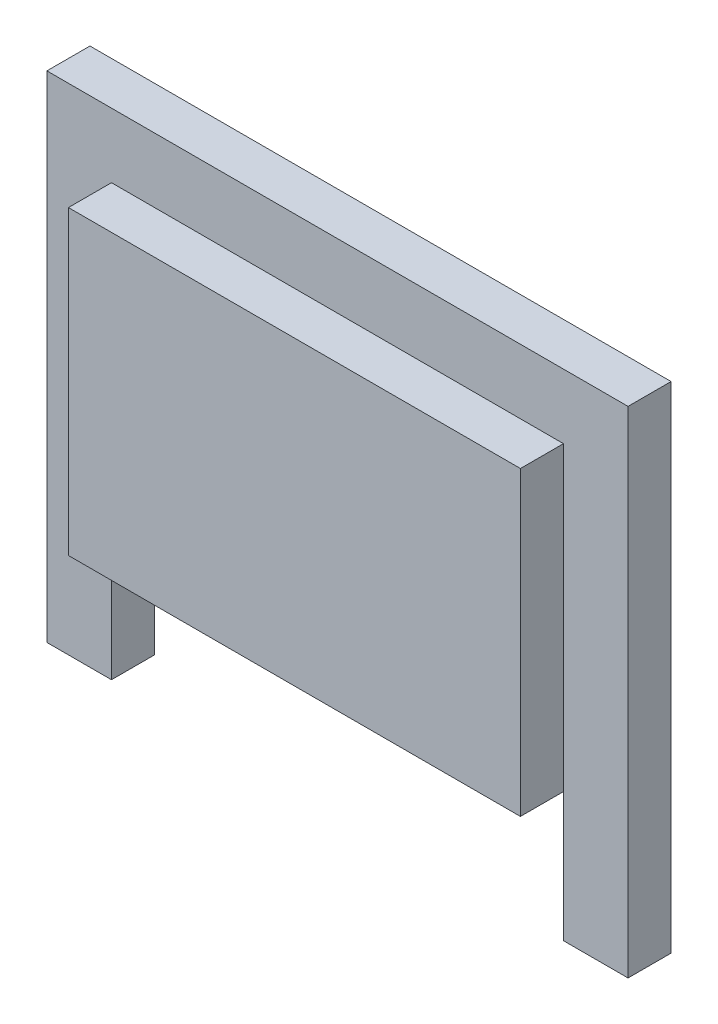
ISO-10303-21;
HEADER;
FILE_DESCRIPTION(('STEP AP214'),'2;1');
FILE_NAME('part.step','',(''),(''),'','','');
FILE_SCHEMA(('AUTOMOTIVE_DESIGN { 1 0 10303 214 1 1 1 1 }'));
ENDSEC;
DATA;
#1=APPLICATION_CONTEXT('core data for automotive mechanical design processes');
#2=APPLICATION_PROTOCOL_DEFINITION('international standard','automotive_design',2000,#1);
#3=PRODUCT_CONTEXT('',#1,'mechanical');
#4=PRODUCT('Part','Part','',(#3));
#5=PRODUCT_RELATED_PRODUCT_CATEGORY('part','',(#4));
#6=PRODUCT_DEFINITION_FORMATION('','',#4);
#7=PRODUCT_DEFINITION_CONTEXT('part definition',#1,'design');
#8=PRODUCT_DEFINITION('design','',#6,#7);
#9=PRODUCT_DEFINITION_SHAPE('','',#8);
#10=(LENGTH_UNIT() NAMED_UNIT(*) SI_UNIT(.MILLI.,.METRE.));
#11=(NAMED_UNIT(*) PLANE_ANGLE_UNIT() SI_UNIT($,.RADIAN.));
#12=(NAMED_UNIT(*) SI_UNIT($,.STERADIAN.) SOLID_ANGLE_UNIT());
#13=UNCERTAINTY_MEASURE_WITH_UNIT(LENGTH_MEASURE(1.E-05),#10,'distance_accuracy_value','');
#14=(GEOMETRIC_REPRESENTATION_CONTEXT(3) GLOBAL_UNCERTAINTY_ASSIGNED_CONTEXT((#13)) GLOBAL_UNIT_ASSIGNED_CONTEXT((#10,
#11,#12)) REPRESENTATION_CONTEXT('',''));
#15=CARTESIAN_POINT('',(0.,0.,0.));
#16=DIRECTION('',(0.,0.,1.));
#17=DIRECTION('',(1.,0.,0.));
#18=AXIS2_PLACEMENT_3D('',#15,#16,#17);
#19=CARTESIAN_POINT('',(-13.5,-11.5,2.));
#20=DIRECTION('',(0.,1.,0.));
#21=DIRECTION('',(0.,0.,1.));
#22=AXIS2_PLACEMENT_3D('',#19,#20,#21);
#23=PLANE('',#22);
#24=DIRECTION('',(1.,0.,0.));
#25=VECTOR('',#24,1.);
#26=CARTESIAN_POINT('',(-13.5,-11.5,0.));
#27=LINE('',#26,#25);
#28=CARTESIAN_POINT('',(-13.5,-11.5,0.));
#29=VERTEX_POINT('',#28);
#30=CARTESIAN_POINT('',(-10.5,-11.5,0.));
#31=VERTEX_POINT('',#30);
#32=EDGE_CURVE('E141',#29,#31,#27,.T.);
#33=ORIENTED_EDGE('',*,*,#32,.T.);
#34=DIRECTION('',(0.,0.,1.));
#35=VECTOR('',#34,1.);
#36=CARTESIAN_POINT('',(-10.5,-11.5,0.));
#37=LINE('',#36,#35);
#38=CARTESIAN_POINT('',(-10.5,-11.5,2.));
#39=VERTEX_POINT('',#38);
#40=EDGE_CURVE('E123',#31,#39,#37,.T.);
#41=ORIENTED_EDGE('',*,*,#40,.T.);
#42=DIRECTION('',(1.,0.,0.));
#43=VECTOR('',#42,1.);
#44=CARTESIAN_POINT('',(-13.5,-11.5,2.));
#45=LINE('',#44,#43);
#46=CARTESIAN_POINT('',(-13.5,-11.5,2.));
#47=VERTEX_POINT('',#46);
#48=EDGE_CURVE('E168',#47,#39,#45,.T.);
#49=ORIENTED_EDGE('',*,*,#48,.F.);
#50=DIRECTION('',(0.,0.,-1.));
#51=VECTOR('',#50,1.);
#52=CARTESIAN_POINT('',(-13.5,-11.5,2.));
#53=LINE('',#52,#51);
#54=EDGE_CURVE('E150',#47,#29,#53,.T.);
#55=ORIENTED_EDGE('',*,*,#54,.T.);
#56=EDGE_LOOP('',(#33,#41,#49,#55));
#57=FACE_BOUND('',#56,.T.);
#58=ADVANCED_FACE('F39',(#57),#23,.F.);
#59=CARTESIAN_POINT('',(0.,0.,2.));
#60=DIRECTION('',(0.,0.,-1.));
#61=DIRECTION('',(-1.,0.,0.));
#62=AXIS2_PLACEMENT_3D('',#59,#60,#61);
#63=PLANE('',#62);
#64=ORIENTED_EDGE('',*,*,#48,.T.);
#65=DIRECTION('',(0.,-1.,0.));
#66=VECTOR('',#65,1.);
#67=CARTESIAN_POINT('',(-10.5,-5.5,2.));
#68=LINE('',#67,#66);
#69=CARTESIAN_POINT('',(-10.5,-5.5,2.));
#70=VERTEX_POINT('',#69);
#71=EDGE_CURVE('E128',#70,#39,#68,.T.);
#72=ORIENTED_EDGE('',*,*,#71,.F.);
#73=DIRECTION('',(0.,-1.,0.));
#74=VECTOR('',#73,1.);
#75=CARTESIAN_POINT('',(-10.5,8.5,2.));
#76=LINE('',#75,#74);
#77=CARTESIAN_POINT('',(-10.5,8.5,2.));
#78=VERTEX_POINT('',#77);
#79=EDGE_CURVE('E55',#78,#70,#76,.T.);
#80=ORIENTED_EDGE('',*,*,#79,.F.);
#81=DIRECTION('',(-1.,0.,0.));
#82=VECTOR('',#81,1.);
#83=CARTESIAN_POINT('',(-10.5,8.5,2.));
#84=LINE('',#83,#82);
#85=CARTESIAN_POINT('',(10.5,8.5,2.));
#86=VERTEX_POINT('',#85);
#87=EDGE_CURVE('E59',#86,#78,#84,.T.);
#88=ORIENTED_EDGE('',*,*,#87,.F.);
#89=DIRECTION('',(0.,1.,0.));
#90=VECTOR('',#89,1.);
#91=CARTESIAN_POINT('',(10.5,8.5,2.));
#92=LINE('',#91,#90);
#93=CARTESIAN_POINT('',(10.5,-5.5,2.));
#94=VERTEX_POINT('',#93);
#95=EDGE_CURVE('E214',#94,#86,#92,.T.);
#96=ORIENTED_EDGE('',*,*,#95,.F.);
#97=DIRECTION('',(0.,1.,0.));
#98=VECTOR('',#97,1.);
#99=CARTESIAN_POINT('',(10.5,-5.5,2.));
#100=LINE('',#99,#98);
#101=CARTESIAN_POINT('',(10.5,-11.5,2.));
#102=VERTEX_POINT('',#101);
#103=EDGE_CURVE('E146',#102,#94,#100,.T.);
#104=ORIENTED_EDGE('',*,*,#103,.F.);
#105=CARTESIAN_POINT('',(13.5,-11.5,2.));
#106=VERTEX_POINT('',#105);
#107=EDGE_CURVE('E190',#102,#106,#45,.T.);
#108=ORIENTED_EDGE('',*,*,#107,.T.);
#109=DIRECTION('',(0.,1.,0.));
#110=VECTOR('',#109,1.);
#111=CARTESIAN_POINT('',(13.5,-11.5,2.));
#112=LINE('',#111,#110);
#113=CARTESIAN_POINT('',(13.5,11.5,2.));
#114=VERTEX_POINT('',#113);
#115=EDGE_CURVE('E152',#106,#114,#112,.T.);
#116=ORIENTED_EDGE('',*,*,#115,.T.);
#117=DIRECTION('',(-1.,0.,0.));
#118=VECTOR('',#117,1.);
#119=CARTESIAN_POINT('',(-13.5,11.5,2.));
#120=LINE('',#119,#118);
#121=CARTESIAN_POINT('',(-13.5,11.5,2.));
#122=VERTEX_POINT('',#121);
#123=EDGE_CURVE('E158',#114,#122,#120,.T.);
#124=ORIENTED_EDGE('',*,*,#123,.T.);
#125=DIRECTION('',(0.,-1.,0.));
#126=VECTOR('',#125,1.);
#127=CARTESIAN_POINT('',(-13.5,-11.5,2.));
#128=LINE('',#127,#126);
#129=EDGE_CURVE('E176',#122,#47,#128,.T.);
#130=ORIENTED_EDGE('',*,*,#129,.T.);
#131=EDGE_LOOP('',(#64,#72,#80,#88,#96,#104,#108,#116,#124,#130));
#132=FACE_BOUND('',#131,.T.);
#133=ADVANCED_FACE('F257',(#132),#63,.F.);
#134=CARTESIAN_POINT('',(13.5,-11.5,2.));
#135=DIRECTION('',(-1.,0.,0.));
#136=DIRECTION('',(0.,0.,1.));
#137=AXIS2_PLACEMENT_3D('',#134,#135,#136);
#138=PLANE('',#137);
#139=DIRECTION('',(0.,1.,0.));
#140=VECTOR('',#139,1.);
#141=CARTESIAN_POINT('',(13.5,-11.5,0.));
#142=LINE('',#141,#140);
#143=CARTESIAN_POINT('',(13.5,-11.5,0.));
#144=VERTEX_POINT('',#143);
#145=CARTESIAN_POINT('',(13.5,11.5,0.));
#146=VERTEX_POINT('',#145);
#147=EDGE_CURVE('E182',#144,#146,#142,.T.);
#148=ORIENTED_EDGE('',*,*,#147,.T.);
#149=DIRECTION('',(0.,0.,-1.));
#150=VECTOR('',#149,1.);
#151=CARTESIAN_POINT('',(13.5,11.5,2.));
#152=LINE('',#151,#150);
#153=EDGE_CURVE('E11',#114,#146,#152,.T.);
#154=ORIENTED_EDGE('',*,*,#153,.F.);
#155=ORIENTED_EDGE('',*,*,#115,.F.);
#156=DIRECTION('',(0.,0.,-1.));
#157=VECTOR('',#156,1.);
#158=CARTESIAN_POINT('',(13.5,-11.5,2.));
#159=LINE('',#158,#157);
#160=EDGE_CURVE('E164',#106,#144,#159,.T.);
#161=ORIENTED_EDGE('',*,*,#160,.T.);
#162=EDGE_LOOP('',(#148,#154,#155,#161));
#163=FACE_BOUND('',#162,.T.);
#164=ADVANCED_FACE('F41',(#163),#138,.F.);
#165=CARTESIAN_POINT('',(-13.5,11.5,2.));
#166=DIRECTION('',(0.,-1.,0.));
#167=DIRECTION('',(0.,0.,-1.));
#168=AXIS2_PLACEMENT_3D('',#165,#166,#167);
#169=PLANE('',#168);
#170=DIRECTION('',(-1.,0.,0.));
#171=VECTOR('',#170,1.);
#172=CARTESIAN_POINT('',(-13.5,11.5,0.));
#173=LINE('',#172,#171);
#174=CARTESIAN_POINT('',(-13.5,11.5,0.));
#175=VERTEX_POINT('',#174);
#176=EDGE_CURVE('E179',#146,#175,#173,.T.);
#177=ORIENTED_EDGE('',*,*,#176,.T.);
#178=DIRECTION('',(0.,0.,-1.));
#179=VECTOR('',#178,1.);
#180=CARTESIAN_POINT('',(-13.5,11.5,2.));
#181=LINE('',#180,#179);
#182=EDGE_CURVE('E48',#122,#175,#181,.T.);
#183=ORIENTED_EDGE('',*,*,#182,.F.);
#184=ORIENTED_EDGE('',*,*,#123,.F.);
#185=ORIENTED_EDGE('',*,*,#153,.T.);
#186=EDGE_LOOP('',(#177,#183,#184,#185));
#187=FACE_BOUND('',#186,.T.);
#188=ADVANCED_FACE('F264',(#187),#169,.F.);
#189=CARTESIAN_POINT('',(-13.5,-11.5,2.));
#190=DIRECTION('',(1.,0.,0.));
#191=DIRECTION('',(0.,0.,-1.));
#192=AXIS2_PLACEMENT_3D('',#189,#190,#191);
#193=PLANE('',#192);
#194=DIRECTION('',(0.,-1.,0.));
#195=VECTOR('',#194,1.);
#196=CARTESIAN_POINT('',(-13.5,-11.5,0.));
#197=LINE('',#196,#195);
#198=EDGE_CURVE('E160',#175,#29,#197,.T.);
#199=ORIENTED_EDGE('',*,*,#198,.T.);
#200=ORIENTED_EDGE('',*,*,#54,.F.);
#201=ORIENTED_EDGE('',*,*,#129,.F.);
#202=ORIENTED_EDGE('',*,*,#182,.T.);
#203=EDGE_LOOP('',(#199,#200,#201,#202));
#204=FACE_BOUND('',#203,.T.);
#205=ADVANCED_FACE('F175',(#204),#193,.F.);
#206=ORIENTED_EDGE('',*,*,#107,.F.);
#207=DIRECTION('',(0.,0.,1.));
#208=VECTOR('',#207,1.);
#209=CARTESIAN_POINT('',(10.5,-11.5,0.));
#210=LINE('',#209,#208);
#211=CARTESIAN_POINT('',(10.5,-11.5,0.));
#212=VERTEX_POINT('',#211);
#213=EDGE_CURVE('E134',#212,#102,#210,.T.);
#214=ORIENTED_EDGE('',*,*,#213,.F.);
#215=EDGE_CURVE('E153',#212,#144,#27,.T.);
#216=ORIENTED_EDGE('',*,*,#215,.T.);
#217=ORIENTED_EDGE('',*,*,#160,.F.);
#218=EDGE_LOOP('',(#206,#214,#216,#217));
#219=FACE_BOUND('',#218,.T.);
#220=ADVANCED_FACE('F253',(#219),#23,.F.);
#221=CARTESIAN_POINT('',(0.,0.,0.));
#222=DIRECTION('',(0.,0.,-1.));
#223=DIRECTION('',(-1.,0.,0.));
#224=AXIS2_PLACEMENT_3D('',#221,#222,#223);
#225=PLANE('',#224);
#226=DIRECTION('',(0.,-1.,0.));
#227=VECTOR('',#226,1.);
#228=CARTESIAN_POINT('',(-10.5,-5.5,0.));
#229=LINE('',#228,#227);
#230=CARTESIAN_POINT('',(-10.5,-5.5,0.));
#231=VERTEX_POINT('',#230);
#232=EDGE_CURVE('E126',#231,#31,#229,.T.);
#233=ORIENTED_EDGE('',*,*,#232,.T.);
#234=ORIENTED_EDGE('',*,*,#32,.F.);
#235=ORIENTED_EDGE('',*,*,#198,.F.);
#236=ORIENTED_EDGE('',*,*,#176,.F.);
#237=ORIENTED_EDGE('',*,*,#147,.F.);
#238=ORIENTED_EDGE('',*,*,#215,.F.);
#239=DIRECTION('',(0.,1.,0.));
#240=VECTOR('',#239,1.);
#241=CARTESIAN_POINT('',(10.5,-5.5,0.));
#242=LINE('',#241,#240);
#243=CARTESIAN_POINT('',(10.5,-5.5,0.));
#244=VERTEX_POINT('',#243);
#245=EDGE_CURVE('E145',#212,#244,#242,.T.);
#246=ORIENTED_EDGE('',*,*,#245,.T.);
#247=DIRECTION('',(-1.,0.,0.));
#248=VECTOR('',#247,1.);
#249=CARTESIAN_POINT('',(-10.5,-5.5,0.));
#250=LINE('',#249,#248);
#251=EDGE_CURVE('E135',#244,#231,#250,.T.);
#252=ORIENTED_EDGE('',*,*,#251,.T.);
#253=EDGE_LOOP('',(#233,#234,#235,#236,#237,#238,#246,#252));
#254=FACE_BOUND('',#253,.T.);
#255=ADVANCED_FACE('F139',(#254),#225,.T.);
#256=CARTESIAN_POINT('',(-10.5,8.5,4.));
#257=DIRECTION('',(1.,0.,0.));
#258=DIRECTION('',(0.,1.,0.));
#259=AXIS2_PLACEMENT_3D('',#256,#257,#258);
#260=PLANE('',#259);
#261=ORIENTED_EDGE('',*,*,#79,.T.);
#262=DIRECTION('',(0.,0.,-1.));
#263=VECTOR('',#262,1.);
#264=CARTESIAN_POINT('',(-10.5,-5.5,4.));
#265=LINE('',#264,#263);
#266=CARTESIAN_POINT('',(-10.5,-5.5,4.));
#267=VERTEX_POINT('',#266);
#268=EDGE_CURVE('E185',#267,#70,#265,.T.);
#269=ORIENTED_EDGE('',*,*,#268,.F.);
#270=DIRECTION('',(0.,-1.,0.));
#271=VECTOR('',#270,1.);
#272=CARTESIAN_POINT('',(-10.5,8.5,4.));
#273=LINE('',#272,#271);
#274=CARTESIAN_POINT('',(-10.5,8.5,4.));
#275=VERTEX_POINT('',#274);
#276=EDGE_CURVE('E213',#275,#267,#273,.T.);
#277=ORIENTED_EDGE('',*,*,#276,.F.);
#278=DIRECTION('',(0.,0.,-1.));
#279=VECTOR('',#278,1.);
#280=CARTESIAN_POINT('',(-10.5,8.5,4.));
#281=LINE('',#280,#279);
#282=EDGE_CURVE('E206',#275,#78,#281,.T.);
#283=ORIENTED_EDGE('',*,*,#282,.T.);
#284=EDGE_LOOP('',(#261,#269,#277,#283));
#285=FACE_BOUND('',#284,.T.);
#286=ADVANCED_FACE('F283',(#285),#260,.F.);
#287=CARTESIAN_POINT('',(-10.5,-5.5,4.));
#288=DIRECTION('',(0.,1.,0.));
#289=DIRECTION('',(0.,0.,1.));
#290=AXIS2_PLACEMENT_3D('',#287,#288,#289);
#291=PLANE('',#290);
#292=ORIENTED_EDGE('',*,*,#268,.T.);
#293=DIRECTION('',(0.,0.,1.));
#294=VECTOR('',#293,1.);
#295=CARTESIAN_POINT('',(-10.5,-5.5,0.));
#296=LINE('',#295,#294);
#297=EDGE_CURVE('E219',#231,#70,#296,.T.);
#298=ORIENTED_EDGE('',*,*,#297,.F.);
#299=ORIENTED_EDGE('',*,*,#251,.F.);
#300=DIRECTION('',(0.,0.,1.));
#301=VECTOR('',#300,1.);
#302=CARTESIAN_POINT('',(10.5,-5.5,0.));
#303=LINE('',#302,#301);
#304=EDGE_CURVE('E233',#244,#94,#303,.T.);
#305=ORIENTED_EDGE('',*,*,#304,.T.);
#306=DIRECTION('',(0.,0.,-1.));
#307=VECTOR('',#306,1.);
#308=CARTESIAN_POINT('',(10.5,-5.5,4.));
#309=LINE('',#308,#307);
#310=CARTESIAN_POINT('',(10.5,-5.5,4.));
#311=VERTEX_POINT('',#310);
#312=EDGE_CURVE('E198',#311,#94,#309,.T.);
#313=ORIENTED_EDGE('',*,*,#312,.F.);
#314=DIRECTION('',(1.,0.,0.));
#315=VECTOR('',#314,1.);
#316=CARTESIAN_POINT('',(-10.5,-5.5,4.));
#317=LINE('',#316,#315);
#318=EDGE_CURVE('E225',#267,#311,#317,.T.);
#319=ORIENTED_EDGE('',*,*,#318,.F.);
#320=EDGE_LOOP('',(#292,#298,#299,#305,#313,#319));
#321=FACE_BOUND('',#320,.T.);
#322=ADVANCED_FACE('F261',(#321),#291,.F.);
#323=CARTESIAN_POINT('',(10.5,8.5,4.));
#324=DIRECTION('',(-1.,0.,0.));
#325=DIRECTION('',(0.,-1.,0.));
#326=AXIS2_PLACEMENT_3D('',#323,#324,#325);
#327=PLANE('',#326);
#328=ORIENTED_EDGE('',*,*,#95,.T.);
#329=DIRECTION('',(0.,0.,-1.));
#330=VECTOR('',#329,1.);
#331=CARTESIAN_POINT('',(10.5,8.5,4.));
#332=LINE('',#331,#330);
#333=CARTESIAN_POINT('',(10.5,8.5,4.));
#334=VERTEX_POINT('',#333);
#335=EDGE_CURVE('E202',#334,#86,#332,.T.);
#336=ORIENTED_EDGE('',*,*,#335,.F.);
#337=DIRECTION('',(0.,1.,0.));
#338=VECTOR('',#337,1.);
#339=CARTESIAN_POINT('',(10.5,8.5,4.));
#340=LINE('',#339,#338);
#341=EDGE_CURVE('E222',#311,#334,#340,.T.);
#342=ORIENTED_EDGE('',*,*,#341,.F.);
#343=ORIENTED_EDGE('',*,*,#312,.T.);
#344=EDGE_LOOP('',(#328,#336,#342,#343));
#345=FACE_BOUND('',#344,.T.);
#346=ADVANCED_FACE('F330',(#345),#327,.F.);
#347=CARTESIAN_POINT('',(-10.5,8.5,4.));
#348=DIRECTION('',(0.,-1.,0.));
#349=DIRECTION('',(0.,0.,-1.));
#350=AXIS2_PLACEMENT_3D('',#347,#348,#349);
#351=PLANE('',#350);
#352=ORIENTED_EDGE('',*,*,#87,.T.);
#353=ORIENTED_EDGE('',*,*,#282,.F.);
#354=DIRECTION('',(-1.,0.,0.));
#355=VECTOR('',#354,1.);
#356=CARTESIAN_POINT('',(-10.5,8.5,4.));
#357=LINE('',#356,#355);
#358=EDGE_CURVE('E210',#334,#275,#357,.T.);
#359=ORIENTED_EDGE('',*,*,#358,.F.);
#360=ORIENTED_EDGE('',*,*,#335,.T.);
#361=EDGE_LOOP('',(#352,#353,#359,#360));
#362=FACE_BOUND('',#361,.T.);
#363=ADVANCED_FACE('F341',(#362),#351,.F.);
#364=CARTESIAN_POINT('',(0.,0.,4.));
#365=DIRECTION('',(0.,0.,1.));
#366=DIRECTION('',(1.,0.,0.));
#367=AXIS2_PLACEMENT_3D('',#364,#365,#366);
#368=PLANE('',#367);
#369=ORIENTED_EDGE('',*,*,#276,.T.);
#370=ORIENTED_EDGE('',*,*,#318,.T.);
#371=ORIENTED_EDGE('',*,*,#341,.T.);
#372=ORIENTED_EDGE('',*,*,#358,.T.);
#373=EDGE_LOOP('',(#369,#370,#371,#372));
#374=FACE_BOUND('',#373,.T.);
#375=ADVANCED_FACE('F350',(#374),#368,.T.);
#376=CARTESIAN_POINT('',(-10.5,-5.5,0.));
#377=DIRECTION('',(-1.,0.,0.));
#378=DIRECTION('',(0.,0.,1.));
#379=AXIS2_PLACEMENT_3D('',#376,#377,#378);
#380=PLANE('',#379);
#381=ORIENTED_EDGE('',*,*,#71,.T.);
#382=ORIENTED_EDGE('',*,*,#40,.F.);
#383=ORIENTED_EDGE('',*,*,#232,.F.);
#384=ORIENTED_EDGE('',*,*,#297,.T.);
#385=EDGE_LOOP('',(#381,#382,#383,#384));
#386=FACE_BOUND('',#385,.T.);
#387=ADVANCED_FACE('F125',(#386),#380,.F.);
#388=CARTESIAN_POINT('',(10.5,-5.5,0.));
#389=DIRECTION('',(1.,0.,0.));
#390=DIRECTION('',(0.,0.,-1.));
#391=AXIS2_PLACEMENT_3D('',#388,#389,#390);
#392=PLANE('',#391);
#393=ORIENTED_EDGE('',*,*,#103,.T.);
#394=ORIENTED_EDGE('',*,*,#304,.F.);
#395=ORIENTED_EDGE('',*,*,#245,.F.);
#396=ORIENTED_EDGE('',*,*,#213,.T.);
#397=EDGE_LOOP('',(#393,#394,#395,#396));
#398=FACE_BOUND('',#397,.T.);
#399=ADVANCED_FACE('F249',(#398),#392,.F.);
#400=CLOSED_SHELL('',(#58,#133,#164,#188,#205,#220,#255,#286,#322,#346,#363,#375,#387,#399));
#401=MANIFOLD_SOLID_BREP('B2',#400);
#402=ADVANCED_BREP_SHAPE_REPRESENTATION('',(#18,#401),#14);
#403=SHAPE_DEFINITION_REPRESENTATION(#9,#402);
ENDSEC;
END-ISO-10303-21;
